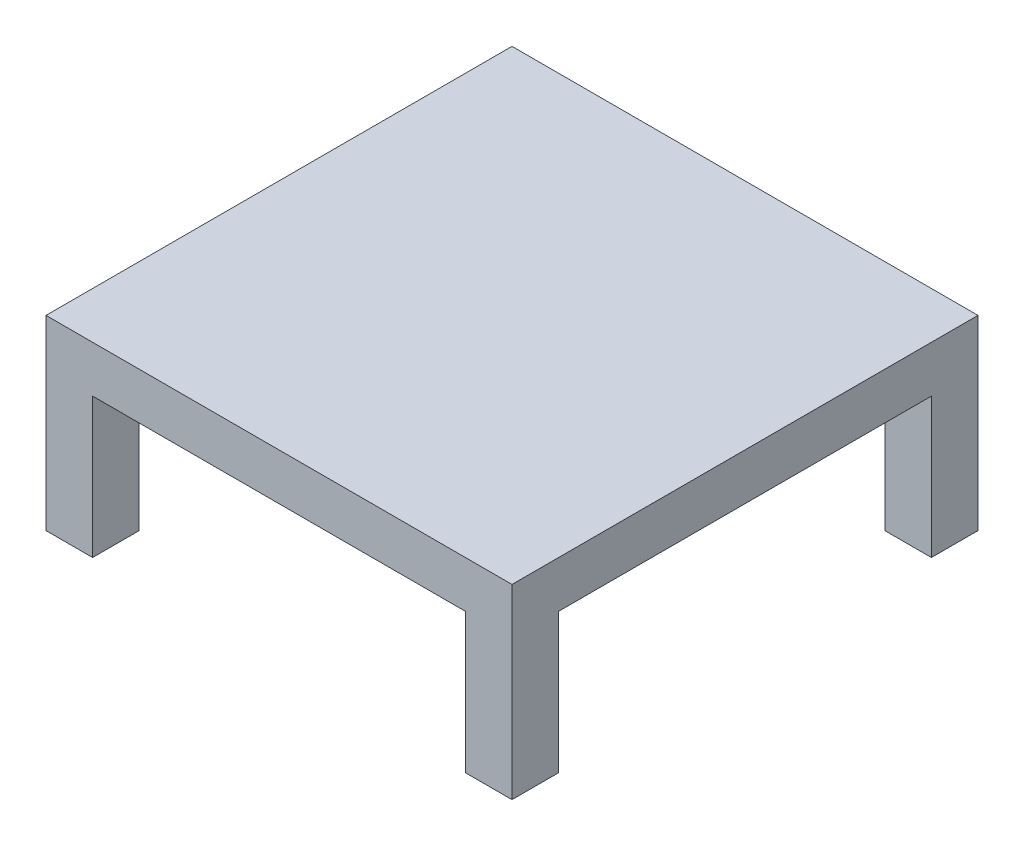
ISO-10303-21;
HEADER;
FILE_DESCRIPTION(('STEP AP214'),'2;1');
FILE_NAME('part.step','',(''),(''),'','','');
FILE_SCHEMA(('AUTOMOTIVE_DESIGN { 1 0 10303 214 1 1 1 1 }'));
ENDSEC;
DATA;
#1=APPLICATION_CONTEXT('core data for automotive mechanical design processes');
#2=APPLICATION_PROTOCOL_DEFINITION('international standard','automotive_design',2000,#1);
#3=PRODUCT_CONTEXT('',#1,'mechanical');
#4=PRODUCT('Part','Part','',(#3));
#5=PRODUCT_RELATED_PRODUCT_CATEGORY('part','',(#4));
#6=PRODUCT_DEFINITION_FORMATION('','',#4);
#7=PRODUCT_DEFINITION_CONTEXT('part definition',#1,'design');
#8=PRODUCT_DEFINITION('design','',#6,#7);
#9=PRODUCT_DEFINITION_SHAPE('','',#8);
#10=(LENGTH_UNIT() NAMED_UNIT(*) SI_UNIT(.MILLI.,.METRE.));
#11=(NAMED_UNIT(*) PLANE_ANGLE_UNIT() SI_UNIT($,.RADIAN.));
#12=(NAMED_UNIT(*) SI_UNIT($,.STERADIAN.) SOLID_ANGLE_UNIT());
#13=UNCERTAINTY_MEASURE_WITH_UNIT(LENGTH_MEASURE(1.E-05),#10,'distance_accuracy_value','');
#14=(GEOMETRIC_REPRESENTATION_CONTEXT(3) GLOBAL_UNCERTAINTY_ASSIGNED_CONTEXT((#13)) GLOBAL_UNIT_ASSIGNED_CONTEXT((#10,
#11,#12)) REPRESENTATION_CONTEXT('',''));
#15=CARTESIAN_POINT('',(0.,0.,0.));
#16=DIRECTION('',(0.,0.,1.));
#17=DIRECTION('',(1.,0.,0.));
#18=AXIS2_PLACEMENT_3D('',#15,#16,#17);
#19=CARTESIAN_POINT('',(0.,0.,0.));
#20=DIRECTION('',(0.,1.,0.));
#21=DIRECTION('',(0.,0.,1.));
#22=AXIS2_PLACEMENT_3D('',#19,#20,#21);
#23=PLANE('',#22);
#24=DIRECTION('',(-1.,0.,0.));
#25=VECTOR('',#24,1.);
#26=CARTESIAN_POINT('',(50.,0.,-40.));
#27=LINE('',#26,#25);
#28=CARTESIAN_POINT('',(50.,0.,-40.));
#29=VERTEX_POINT('',#28);
#30=CARTESIAN_POINT('',(40.,0.,-40.));
#31=VERTEX_POINT('',#30);
#32=EDGE_CURVE('E532',#29,#31,#27,.T.);
#33=ORIENTED_EDGE('',*,*,#32,.F.);
#34=DIRECTION('',(0.,0.,-1.));
#35=VECTOR('',#34,1.);
#36=CARTESIAN_POINT('',(50.,0.,-50.));
#37=LINE('',#36,#35);
#38=CARTESIAN_POINT('',(50.,0.,40.));
#39=VERTEX_POINT('',#38);
#40=EDGE_CURVE('E178',#39,#29,#37,.T.);
#41=ORIENTED_EDGE('',*,*,#40,.F.);
#42=DIRECTION('',(1.,0.,0.));
#43=VECTOR('',#42,1.);
#44=CARTESIAN_POINT('',(50.,0.,40.));
#45=LINE('',#44,#43);
#46=CARTESIAN_POINT('',(40.,0.,40.));
#47=VERTEX_POINT('',#46);
#48=EDGE_CURVE('E252',#47,#39,#45,.T.);
#49=ORIENTED_EDGE('',*,*,#48,.F.);
#50=DIRECTION('',(0.,0.,-1.));
#51=VECTOR('',#50,1.);
#52=CARTESIAN_POINT('',(40.,0.,50.));
#53=LINE('',#52,#51);
#54=CARTESIAN_POINT('',(40.,0.,50.));
#55=VERTEX_POINT('',#54);
#56=EDGE_CURVE('E246',#55,#47,#53,.T.);
#57=ORIENTED_EDGE('',*,*,#56,.F.);
#58=DIRECTION('',(1.,0.,0.));
#59=VECTOR('',#58,1.);
#60=CARTESIAN_POINT('',(-50.,0.,50.));
#61=LINE('',#60,#59);
#62=CARTESIAN_POINT('',(-40.,0.,50.));
#63=VERTEX_POINT('',#62);
#64=EDGE_CURVE('E283',#63,#55,#61,.T.);
#65=ORIENTED_EDGE('',*,*,#64,.F.);
#66=DIRECTION('',(0.,0.,1.));
#67=VECTOR('',#66,1.);
#68=CARTESIAN_POINT('',(-40.,0.,50.));
#69=LINE('',#68,#67);
#70=CARTESIAN_POINT('',(-40.,0.,40.));
#71=VERTEX_POINT('',#70);
#72=EDGE_CURVE('E220',#71,#63,#69,.T.);
#73=ORIENTED_EDGE('',*,*,#72,.F.);
#74=DIRECTION('',(1.,0.,0.));
#75=VECTOR('',#74,1.);
#76=CARTESIAN_POINT('',(-50.,0.,40.));
#77=LINE('',#76,#75);
#78=CARTESIAN_POINT('',(-50.,0.,40.));
#79=VERTEX_POINT('',#78);
#80=EDGE_CURVE('E214',#79,#71,#77,.T.);
#81=ORIENTED_EDGE('',*,*,#80,.F.);
#82=DIRECTION('',(0.,0.,1.));
#83=VECTOR('',#82,1.);
#84=CARTESIAN_POINT('',(-50.,0.,-50.));
#85=LINE('',#84,#83);
#86=CARTESIAN_POINT('',(-50.,0.,-40.));
#87=VERTEX_POINT('',#86);
#88=EDGE_CURVE('E298',#87,#79,#85,.T.);
#89=ORIENTED_EDGE('',*,*,#88,.F.);
#90=DIRECTION('',(-1.,0.,0.));
#91=VECTOR('',#90,1.);
#92=CARTESIAN_POINT('',(-50.,0.,-40.));
#93=LINE('',#92,#91);
#94=CARTESIAN_POINT('',(-40.,0.,-40.));
#95=VERTEX_POINT('',#94);
#96=EDGE_CURVE('E184',#95,#87,#93,.T.);
#97=ORIENTED_EDGE('',*,*,#96,.F.);
#98=DIRECTION('',(0.,0.,1.));
#99=VECTOR('',#98,1.);
#100=CARTESIAN_POINT('',(-40.,0.,-50.));
#101=LINE('',#100,#99);
#102=CARTESIAN_POINT('',(-40.,0.,-50.));
#103=VERTEX_POINT('',#102);
#104=EDGE_CURVE('E180',#103,#95,#101,.T.);
#105=ORIENTED_EDGE('',*,*,#104,.F.);
#106=DIRECTION('',(-1.,0.,0.));
#107=VECTOR('',#106,1.);
#108=CARTESIAN_POINT('',(-50.,0.,-50.));
#109=LINE('',#108,#107);
#110=CARTESIAN_POINT('',(40.,0.,-50.));
#111=VERTEX_POINT('',#110);
#112=EDGE_CURVE('E295',#111,#103,#109,.T.);
#113=ORIENTED_EDGE('',*,*,#112,.F.);
#114=DIRECTION('',(0.,0.,-1.));
#115=VECTOR('',#114,1.);
#116=CARTESIAN_POINT('',(40.,0.,-50.));
#117=LINE('',#116,#115);
#118=EDGE_CURVE('E174',#31,#111,#117,.T.);
#119=ORIENTED_EDGE('',*,*,#118,.F.);
#120=EDGE_LOOP('',(#33,#41,#49,#57,#65,#73,#81,#89,#97,#105,#113,#119));
#121=FACE_BOUND('',#120,.T.);
#122=ADVANCED_FACE('F39',(#121),#23,.F.);
#123=CARTESIAN_POINT('',(50.,10.,-50.));
#124=DIRECTION('',(-1.,0.,0.));
#125=DIRECTION('',(0.,0.,1.));
#126=AXIS2_PLACEMENT_3D('',#123,#124,#125);
#127=PLANE('',#126);
#128=DIRECTION('',(0.,-1.,0.));
#129=VECTOR('',#128,1.);
#130=CARTESIAN_POINT('',(50.,10.,50.));
#131=LINE('',#130,#129);
#132=CARTESIAN_POINT('',(50.,10.,50.));
#133=VERTEX_POINT('',#132);
#134=CARTESIAN_POINT('',(50.,-30.,50.));
#135=VERTEX_POINT('',#134);
#136=EDGE_CURVE('E292',#133,#135,#131,.T.);
#137=ORIENTED_EDGE('',*,*,#136,.T.);
#138=DIRECTION('',(0.,0.,1.));
#139=VECTOR('',#138,1.);
#140=CARTESIAN_POINT('',(50.,-30.,50.));
#141=LINE('',#140,#139);
#142=CARTESIAN_POINT('',(50.,-30.,40.));
#143=VERTEX_POINT('',#142);
#144=EDGE_CURVE('E247',#143,#135,#141,.T.);
#145=ORIENTED_EDGE('',*,*,#144,.F.);
#146=DIRECTION('',(0.,1.,0.));
#147=VECTOR('',#146,1.);
#148=CARTESIAN_POINT('',(50.,-30.,40.));
#149=LINE('',#148,#147);
#150=EDGE_CURVE('E261',#143,#39,#149,.T.);
#151=ORIENTED_EDGE('',*,*,#150,.T.);
#152=ORIENTED_EDGE('',*,*,#40,.T.);
#153=DIRECTION('',(0.,1.,0.));
#154=VECTOR('',#153,1.);
#155=CARTESIAN_POINT('',(50.,-30.,-40.));
#156=LINE('',#155,#154);
#157=CARTESIAN_POINT('',(50.,-30.,-40.));
#158=VERTEX_POINT('',#157);
#159=EDGE_CURVE('E157',#158,#29,#156,.T.);
#160=ORIENTED_EDGE('',*,*,#159,.F.);
#161=DIRECTION('',(0.,0.,1.));
#162=VECTOR('',#161,1.);
#163=CARTESIAN_POINT('',(50.,-30.,-50.));
#164=LINE('',#163,#162);
#165=CARTESIAN_POINT('',(50.,-30.,-50.));
#166=VERTEX_POINT('',#165);
#167=EDGE_CURVE('E165',#166,#158,#164,.T.);
#168=ORIENTED_EDGE('',*,*,#167,.F.);
#169=DIRECTION('',(0.,-1.,0.));
#170=VECTOR('',#169,1.);
#171=CARTESIAN_POINT('',(50.,10.,-50.));
#172=LINE('',#171,#170);
#173=CARTESIAN_POINT('',(50.,10.,-50.));
#174=VERTEX_POINT('',#173);
#175=EDGE_CURVE('E11',#174,#166,#172,.T.);
#176=ORIENTED_EDGE('',*,*,#175,.F.);
#177=DIRECTION('',(0.,0.,-1.));
#178=VECTOR('',#177,1.);
#179=CARTESIAN_POINT('',(50.,10.,-50.));
#180=LINE('',#179,#178);
#181=EDGE_CURVE('E278',#133,#174,#180,.T.);
#182=ORIENTED_EDGE('',*,*,#181,.F.);
#183=EDGE_LOOP('',(#137,#145,#151,#152,#160,#168,#176,#182));
#184=FACE_BOUND('',#183,.T.);
#185=ADVANCED_FACE('F41',(#184),#127,.F.);
#186=CARTESIAN_POINT('',(-50.,10.,-50.));
#187=DIRECTION('',(0.,0.,1.));
#188=DIRECTION('',(1.,0.,0.));
#189=AXIS2_PLACEMENT_3D('',#186,#187,#188);
#190=PLANE('',#189);
#191=ORIENTED_EDGE('',*,*,#175,.T.);
#192=DIRECTION('',(1.,0.,0.));
#193=VECTOR('',#192,1.);
#194=CARTESIAN_POINT('',(50.,-30.,-50.));
#195=LINE('',#194,#193);
#196=CARTESIAN_POINT('',(40.,-30.,-50.));
#197=VERTEX_POINT('',#196);
#198=EDGE_CURVE('E170',#197,#166,#195,.T.);
#199=ORIENTED_EDGE('',*,*,#198,.F.);
#200=DIRECTION('',(0.,1.,0.));
#201=VECTOR('',#200,1.);
#202=CARTESIAN_POINT('',(40.,-30.,-50.));
#203=LINE('',#202,#201);
#204=EDGE_CURVE('E55',#197,#111,#203,.T.);
#205=ORIENTED_EDGE('',*,*,#204,.T.);
#206=ORIENTED_EDGE('',*,*,#112,.T.);
#207=DIRECTION('',(0.,1.,0.));
#208=VECTOR('',#207,1.);
#209=CARTESIAN_POINT('',(-40.,-30.,-50.));
#210=LINE('',#209,#208);
#211=CARTESIAN_POINT('',(-40.,-30.,-50.));
#212=VERTEX_POINT('',#211);
#213=EDGE_CURVE('E210',#212,#103,#210,.T.);
#214=ORIENTED_EDGE('',*,*,#213,.F.);
#215=DIRECTION('',(1.,0.,0.));
#216=VECTOR('',#215,1.);
#217=CARTESIAN_POINT('',(-50.,-30.,-50.));
#218=LINE('',#217,#216);
#219=CARTESIAN_POINT('',(-50.,-30.,-50.));
#220=VERTEX_POINT('',#219);
#221=EDGE_CURVE('E193',#220,#212,#218,.T.);
#222=ORIENTED_EDGE('',*,*,#221,.F.);
#223=DIRECTION('',(0.,-1.,0.));
#224=VECTOR('',#223,1.);
#225=CARTESIAN_POINT('',(-50.,10.,-50.));
#226=LINE('',#225,#224);
#227=CARTESIAN_POINT('',(-50.,10.,-50.));
#228=VERTEX_POINT('',#227);
#229=EDGE_CURVE('E48',#228,#220,#226,.T.);
#230=ORIENTED_EDGE('',*,*,#229,.F.);
#231=DIRECTION('',(-1.,0.,0.));
#232=VECTOR('',#231,1.);
#233=CARTESIAN_POINT('',(-50.,10.,-50.));
#234=LINE('',#233,#232);
#235=EDGE_CURVE('E282',#174,#228,#234,.T.);
#236=ORIENTED_EDGE('',*,*,#235,.F.);
#237=EDGE_LOOP('',(#191,#199,#205,#206,#214,#222,#230,#236));
#238=FACE_BOUND('',#237,.T.);
#239=ADVANCED_FACE('F314',(#238),#190,.F.);
#240=CARTESIAN_POINT('',(-50.,10.,-50.));
#241=DIRECTION('',(1.,0.,0.));
#242=DIRECTION('',(0.,0.,-1.));
#243=AXIS2_PLACEMENT_3D('',#240,#241,#242);
#244=PLANE('',#243);
#245=ORIENTED_EDGE('',*,*,#229,.T.);
#246=DIRECTION('',(0.,0.,-1.));
#247=VECTOR('',#246,1.);
#248=CARTESIAN_POINT('',(-50.,-30.,-50.));
#249=LINE('',#248,#247);
#250=CARTESIAN_POINT('',(-50.,-30.,-40.));
#251=VERTEX_POINT('',#250);
#252=EDGE_CURVE('E189',#251,#220,#249,.T.);
#253=ORIENTED_EDGE('',*,*,#252,.F.);
#254=DIRECTION('',(0.,1.,0.));
#255=VECTOR('',#254,1.);
#256=CARTESIAN_POINT('',(-50.,-30.,-40.));
#257=LINE('',#256,#255);
#258=EDGE_CURVE('E63',#251,#87,#257,.T.);
#259=ORIENTED_EDGE('',*,*,#258,.T.);
#260=ORIENTED_EDGE('',*,*,#88,.T.);
#261=DIRECTION('',(0.,1.,0.));
#262=VECTOR('',#261,1.);
#263=CARTESIAN_POINT('',(-50.,-30.,40.));
#264=LINE('',#263,#262);
#265=CARTESIAN_POINT('',(-50.,-30.,40.));
#266=VERTEX_POINT('',#265);
#267=EDGE_CURVE('E242',#266,#79,#264,.T.);
#268=ORIENTED_EDGE('',*,*,#267,.F.);
#269=DIRECTION('',(0.,0.,-1.));
#270=VECTOR('',#269,1.);
#271=CARTESIAN_POINT('',(-50.,-30.,50.));
#272=LINE('',#271,#270);
#273=CARTESIAN_POINT('',(-50.,-30.,50.));
#274=VERTEX_POINT('',#273);
#275=EDGE_CURVE('E215',#274,#266,#272,.T.);
#276=ORIENTED_EDGE('',*,*,#275,.F.);
#277=DIRECTION('',(0.,-1.,0.));
#278=VECTOR('',#277,1.);
#279=CARTESIAN_POINT('',(-50.,10.,50.));
#280=LINE('',#279,#278);
#281=CARTESIAN_POINT('',(-50.,10.,50.));
#282=VERTEX_POINT('',#281);
#283=EDGE_CURVE('E305',#282,#274,#280,.T.);
#284=ORIENTED_EDGE('',*,*,#283,.F.);
#285=DIRECTION('',(0.,0.,1.));
#286=VECTOR('',#285,1.);
#287=CARTESIAN_POINT('',(-50.,10.,-50.));
#288=LINE('',#287,#286);
#289=EDGE_CURVE('E286',#228,#282,#288,.T.);
#290=ORIENTED_EDGE('',*,*,#289,.F.);
#291=EDGE_LOOP('',(#245,#253,#259,#260,#268,#276,#284,#290));
#292=FACE_BOUND('',#291,.T.);
#293=ADVANCED_FACE('F311',(#292),#244,.F.);
#294=CARTESIAN_POINT('',(-50.,10.,50.));
#295=DIRECTION('',(0.,0.,-1.));
#296=DIRECTION('',(-1.,0.,0.));
#297=AXIS2_PLACEMENT_3D('',#294,#295,#296);
#298=PLANE('',#297);
#299=ORIENTED_EDGE('',*,*,#283,.T.);
#300=DIRECTION('',(-1.,0.,0.));
#301=VECTOR('',#300,1.);
#302=CARTESIAN_POINT('',(-50.,-30.,50.));
#303=LINE('',#302,#301);
#304=CARTESIAN_POINT('',(-40.,-30.,50.));
#305=VERTEX_POINT('',#304);
#306=EDGE_CURVE('E226',#305,#274,#303,.T.);
#307=ORIENTED_EDGE('',*,*,#306,.F.);
#308=DIRECTION('',(0.,1.,0.));
#309=VECTOR('',#308,1.);
#310=CARTESIAN_POINT('',(-40.,-30.,50.));
#311=LINE('',#310,#309);
#312=EDGE_CURVE('E230',#305,#63,#311,.T.);
#313=ORIENTED_EDGE('',*,*,#312,.T.);
#314=ORIENTED_EDGE('',*,*,#64,.T.);
#315=DIRECTION('',(0.,1.,0.));
#316=VECTOR('',#315,1.);
#317=CARTESIAN_POINT('',(40.,-30.,50.));
#318=LINE('',#317,#316);
#319=CARTESIAN_POINT('',(40.,-30.,50.));
#320=VERTEX_POINT('',#319);
#321=EDGE_CURVE('E274',#320,#55,#318,.T.);
#322=ORIENTED_EDGE('',*,*,#321,.F.);
#323=DIRECTION('',(-1.,0.,0.));
#324=VECTOR('',#323,1.);
#325=CARTESIAN_POINT('',(50.,-30.,50.));
#326=LINE('',#325,#324);
#327=EDGE_CURVE('E251',#135,#320,#326,.T.);
#328=ORIENTED_EDGE('',*,*,#327,.F.);
#329=ORIENTED_EDGE('',*,*,#136,.F.);
#330=DIRECTION('',(1.,0.,0.));
#331=VECTOR('',#330,1.);
#332=CARTESIAN_POINT('',(-50.,10.,50.));
#333=LINE('',#332,#331);
#334=EDGE_CURVE('E289',#282,#133,#333,.T.);
#335=ORIENTED_EDGE('',*,*,#334,.F.);
#336=EDGE_LOOP('',(#299,#307,#313,#314,#322,#328,#329,#335));
#337=FACE_BOUND('',#336,.T.);
#338=ADVANCED_FACE('F340',(#337),#298,.F.);
#339=CARTESIAN_POINT('',(0.,10.,0.));
#340=DIRECTION('',(0.,1.,0.));
#341=DIRECTION('',(0.,0.,1.));
#342=AXIS2_PLACEMENT_3D('',#339,#340,#341);
#343=PLANE('',#342);
#344=ORIENTED_EDGE('',*,*,#181,.T.);
#345=ORIENTED_EDGE('',*,*,#235,.T.);
#346=ORIENTED_EDGE('',*,*,#289,.T.);
#347=ORIENTED_EDGE('',*,*,#334,.T.);
#348=EDGE_LOOP('',(#344,#345,#346,#347));
#349=FACE_BOUND('',#348,.T.);
#350=ADVANCED_FACE('F344',(#349),#343,.T.);
#351=CARTESIAN_POINT('',(40.,-30.,50.));
#352=DIRECTION('',(1.,0.,0.));
#353=DIRECTION('',(0.,0.,-1.));
#354=AXIS2_PLACEMENT_3D('',#351,#352,#353);
#355=PLANE('',#354);
#356=ORIENTED_EDGE('',*,*,#56,.T.);
#357=DIRECTION('',(0.,1.,0.));
#358=VECTOR('',#357,1.);
#359=CARTESIAN_POINT('',(40.,-30.,40.));
#360=LINE('',#359,#358);
#361=CARTESIAN_POINT('',(40.,-30.,40.));
#362=VERTEX_POINT('',#361);
#363=EDGE_CURVE('E270',#362,#47,#360,.T.);
#364=ORIENTED_EDGE('',*,*,#363,.F.);
#365=DIRECTION('',(0.,0.,-1.));
#366=VECTOR('',#365,1.);
#367=CARTESIAN_POINT('',(40.,-30.,50.));
#368=LINE('',#367,#366);
#369=EDGE_CURVE('E255',#320,#362,#368,.T.);
#370=ORIENTED_EDGE('',*,*,#369,.F.);
#371=ORIENTED_EDGE('',*,*,#321,.T.);
#372=EDGE_LOOP('',(#356,#364,#370,#371));
#373=FACE_BOUND('',#372,.T.);
#374=ADVANCED_FACE('F358',(#373),#355,.F.);
#375=CARTESIAN_POINT('',(50.,-30.,40.));
#376=DIRECTION('',(0.,0.,1.));
#377=DIRECTION('',(1.,0.,0.));
#378=AXIS2_PLACEMENT_3D('',#375,#376,#377);
#379=PLANE('',#378);
#380=ORIENTED_EDGE('',*,*,#48,.T.);
#381=ORIENTED_EDGE('',*,*,#150,.F.);
#382=DIRECTION('',(1.,0.,0.));
#383=VECTOR('',#382,1.);
#384=CARTESIAN_POINT('',(50.,-30.,40.));
#385=LINE('',#384,#383);
#386=EDGE_CURVE('E258',#362,#143,#385,.T.);
#387=ORIENTED_EDGE('',*,*,#386,.F.);
#388=ORIENTED_EDGE('',*,*,#363,.T.);
#389=EDGE_LOOP('',(#380,#381,#387,#388));
#390=FACE_BOUND('',#389,.T.);
#391=ADVANCED_FACE('F354',(#390),#379,.F.);
#392=CARTESIAN_POINT('',(0.,-30.,0.));
#393=DIRECTION('',(0.,1.,0.));
#394=DIRECTION('',(0.,0.,1.));
#395=AXIS2_PLACEMENT_3D('',#392,#393,#394);
#396=PLANE('',#395);
#397=ORIENTED_EDGE('',*,*,#144,.T.);
#398=ORIENTED_EDGE('',*,*,#327,.T.);
#399=ORIENTED_EDGE('',*,*,#369,.T.);
#400=ORIENTED_EDGE('',*,*,#386,.T.);
#401=EDGE_LOOP('',(#397,#398,#399,#400));
#402=FACE_BOUND('',#401,.T.);
#403=ADVANCED_FACE('F349',(#402),#396,.F.);
#404=CARTESIAN_POINT('',(-50.,-30.,40.));
#405=DIRECTION('',(0.,0.,1.));
#406=DIRECTION('',(1.,0.,0.));
#407=AXIS2_PLACEMENT_3D('',#404,#405,#406);
#408=PLANE('',#407);
#409=ORIENTED_EDGE('',*,*,#80,.T.);
#410=DIRECTION('',(0.,1.,0.));
#411=VECTOR('',#410,1.);
#412=CARTESIAN_POINT('',(-40.,-30.,40.));
#413=LINE('',#412,#411);
#414=CARTESIAN_POINT('',(-40.,-30.,40.));
#415=VERTEX_POINT('',#414);
#416=EDGE_CURVE('E238',#415,#71,#413,.T.);
#417=ORIENTED_EDGE('',*,*,#416,.F.);
#418=DIRECTION('',(1.,0.,0.));
#419=VECTOR('',#418,1.);
#420=CARTESIAN_POINT('',(-50.,-30.,40.));
#421=LINE('',#420,#419);
#422=EDGE_CURVE('E219',#266,#415,#421,.T.);
#423=ORIENTED_EDGE('',*,*,#422,.F.);
#424=ORIENTED_EDGE('',*,*,#267,.T.);
#425=EDGE_LOOP('',(#409,#417,#423,#424));
#426=FACE_BOUND('',#425,.T.);
#427=ADVANCED_FACE('F331',(#426),#408,.F.);
#428=CARTESIAN_POINT('',(-40.,-30.,50.));
#429=DIRECTION('',(-1.,0.,0.));
#430=DIRECTION('',(0.,0.,1.));
#431=AXIS2_PLACEMENT_3D('',#428,#429,#430);
#432=PLANE('',#431);
#433=ORIENTED_EDGE('',*,*,#72,.T.);
#434=ORIENTED_EDGE('',*,*,#312,.F.);
#435=DIRECTION('',(0.,0.,1.));
#436=VECTOR('',#435,1.);
#437=CARTESIAN_POINT('',(-40.,-30.,50.));
#438=LINE('',#437,#436);
#439=EDGE_CURVE('E223',#415,#305,#438,.T.);
#440=ORIENTED_EDGE('',*,*,#439,.F.);
#441=ORIENTED_EDGE('',*,*,#416,.T.);
#442=EDGE_LOOP('',(#433,#434,#440,#441));
#443=FACE_BOUND('',#442,.T.);
#444=ADVANCED_FACE('F455',(#443),#432,.F.);
#445=CARTESIAN_POINT('',(0.,-30.,0.));
#446=DIRECTION('',(0.,-1.,0.));
#447=DIRECTION('',(0.,0.,-1.));
#448=AXIS2_PLACEMENT_3D('',#445,#446,#447);
#449=PLANE('',#448);
#450=ORIENTED_EDGE('',*,*,#275,.T.);
#451=ORIENTED_EDGE('',*,*,#422,.T.);
#452=ORIENTED_EDGE('',*,*,#439,.T.);
#453=ORIENTED_EDGE('',*,*,#306,.T.);
#454=EDGE_LOOP('',(#450,#451,#452,#453));
#455=FACE_BOUND('',#454,.T.);
#456=ADVANCED_FACE('F335',(#455),#449,.T.);
#457=CARTESIAN_POINT('',(-40.,-30.,-50.));
#458=DIRECTION('',(-1.,0.,0.));
#459=DIRECTION('',(0.,0.,1.));
#460=AXIS2_PLACEMENT_3D('',#457,#458,#459);
#461=PLANE('',#460);
#462=ORIENTED_EDGE('',*,*,#104,.T.);
#463=DIRECTION('',(0.,1.,0.));
#464=VECTOR('',#463,1.);
#465=CARTESIAN_POINT('',(-40.,-30.,-40.));
#466=LINE('',#465,#464);
#467=CARTESIAN_POINT('',(-40.,-30.,-40.));
#468=VERTEX_POINT('',#467);
#469=EDGE_CURVE('E206',#468,#95,#466,.T.);
#470=ORIENTED_EDGE('',*,*,#469,.F.);
#471=DIRECTION('',(0.,0.,1.));
#472=VECTOR('',#471,1.);
#473=CARTESIAN_POINT('',(-40.,-30.,-50.));
#474=LINE('',#473,#472);
#475=EDGE_CURVE('E196',#212,#468,#474,.T.);
#476=ORIENTED_EDGE('',*,*,#475,.F.);
#477=ORIENTED_EDGE('',*,*,#213,.T.);
#478=EDGE_LOOP('',(#462,#470,#476,#477));
#479=FACE_BOUND('',#478,.T.);
#480=ADVANCED_FACE('F471',(#479),#461,.F.);
#481=CARTESIAN_POINT('',(-50.,-30.,-40.));
#482=DIRECTION('',(0.,0.,-1.));
#483=DIRECTION('',(-1.,0.,0.));
#484=AXIS2_PLACEMENT_3D('',#481,#482,#483);
#485=PLANE('',#484);
#486=ORIENTED_EDGE('',*,*,#96,.T.);
#487=ORIENTED_EDGE('',*,*,#258,.F.);
#488=DIRECTION('',(-1.,0.,0.));
#489=VECTOR('',#488,1.);
#490=CARTESIAN_POINT('',(-50.,-30.,-40.));
#491=LINE('',#490,#489);
#492=EDGE_CURVE('E199',#468,#251,#491,.T.);
#493=ORIENTED_EDGE('',*,*,#492,.F.);
#494=ORIENTED_EDGE('',*,*,#469,.T.);
#495=EDGE_LOOP('',(#486,#487,#493,#494));
#496=FACE_BOUND('',#495,.T.);
#497=ADVANCED_FACE('F321',(#496),#485,.F.);
#498=CARTESIAN_POINT('',(0.,-30.,0.));
#499=DIRECTION('',(0.,1.,0.));
#500=DIRECTION('',(0.,0.,1.));
#501=AXIS2_PLACEMENT_3D('',#498,#499,#500);
#502=PLANE('',#501);
#503=ORIENTED_EDGE('',*,*,#252,.T.);
#504=ORIENTED_EDGE('',*,*,#221,.T.);
#505=ORIENTED_EDGE('',*,*,#475,.T.);
#506=ORIENTED_EDGE('',*,*,#492,.T.);
#507=EDGE_LOOP('',(#503,#504,#505,#506));
#508=FACE_BOUND('',#507,.T.);
#509=ADVANCED_FACE('F317',(#508),#502,.F.);
#510=CARTESIAN_POINT('',(50.,-30.,-40.));
#511=DIRECTION('',(0.,0.,-1.));
#512=DIRECTION('',(-1.,0.,0.));
#513=AXIS2_PLACEMENT_3D('',#510,#511,#512);
#514=PLANE('',#513);
#515=ORIENTED_EDGE('',*,*,#32,.T.);
#516=DIRECTION('',(0.,1.,0.));
#517=VECTOR('',#516,1.);
#518=CARTESIAN_POINT('',(40.,-30.,-40.));
#519=LINE('',#518,#517);
#520=CARTESIAN_POINT('',(40.,-30.,-40.));
#521=VERTEX_POINT('',#520);
#522=EDGE_CURVE('E160',#521,#31,#519,.T.);
#523=ORIENTED_EDGE('',*,*,#522,.F.);
#524=DIRECTION('',(-1.,0.,0.));
#525=VECTOR('',#524,1.);
#526=CARTESIAN_POINT('',(50.,-30.,-40.));
#527=LINE('',#526,#525);
#528=EDGE_CURVE('E153',#158,#521,#527,.T.);
#529=ORIENTED_EDGE('',*,*,#528,.F.);
#530=ORIENTED_EDGE('',*,*,#159,.T.);
#531=EDGE_LOOP('',(#515,#523,#529,#530));
#532=FACE_BOUND('',#531,.T.);
#533=ADVANCED_FACE('F155',(#532),#514,.F.);
#534=CARTESIAN_POINT('',(40.,-30.,-50.));
#535=DIRECTION('',(1.,0.,0.));
#536=DIRECTION('',(0.,0.,-1.));
#537=AXIS2_PLACEMENT_3D('',#534,#535,#536);
#538=PLANE('',#537);
#539=ORIENTED_EDGE('',*,*,#118,.T.);
#540=ORIENTED_EDGE('',*,*,#204,.F.);
#541=DIRECTION('',(0.,0.,-1.));
#542=VECTOR('',#541,1.);
#543=CARTESIAN_POINT('',(40.,-30.,-50.));
#544=LINE('',#543,#542);
#545=EDGE_CURVE('E164',#521,#197,#544,.T.);
#546=ORIENTED_EDGE('',*,*,#545,.F.);
#547=ORIENTED_EDGE('',*,*,#522,.T.);
#548=EDGE_LOOP('',(#539,#540,#546,#547));
#549=FACE_BOUND('',#548,.T.);
#550=ADVANCED_FACE('F501',(#549),#538,.F.);
#551=CARTESIAN_POINT('',(0.,-30.,0.));
#552=DIRECTION('',(0.,-1.,0.));
#553=DIRECTION('',(0.,0.,-1.));
#554=AXIS2_PLACEMENT_3D('',#551,#552,#553);
#555=PLANE('',#554);
#556=ORIENTED_EDGE('',*,*,#167,.T.);
#557=ORIENTED_EDGE('',*,*,#528,.T.);
#558=ORIENTED_EDGE('',*,*,#545,.T.);
#559=ORIENTED_EDGE('',*,*,#198,.T.);
#560=EDGE_LOOP('',(#556,#557,#558,#559));
#561=FACE_BOUND('',#560,.T.);
#562=ADVANCED_FACE('F169',(#561),#555,.T.);
#563=CLOSED_SHELL('',(#122,#185,#239,#293,#338,#350,#374,#391,#403,#427,#444,#456,#480,#497,
#509,#533,#550,#562));
#564=MANIFOLD_SOLID_BREP('B2',#563);
#565=ADVANCED_BREP_SHAPE_REPRESENTATION('',(#18,#564),#14);
#566=SHAPE_DEFINITION_REPRESENTATION(#9,#565);
ENDSEC;
END-ISO-10303-21;
